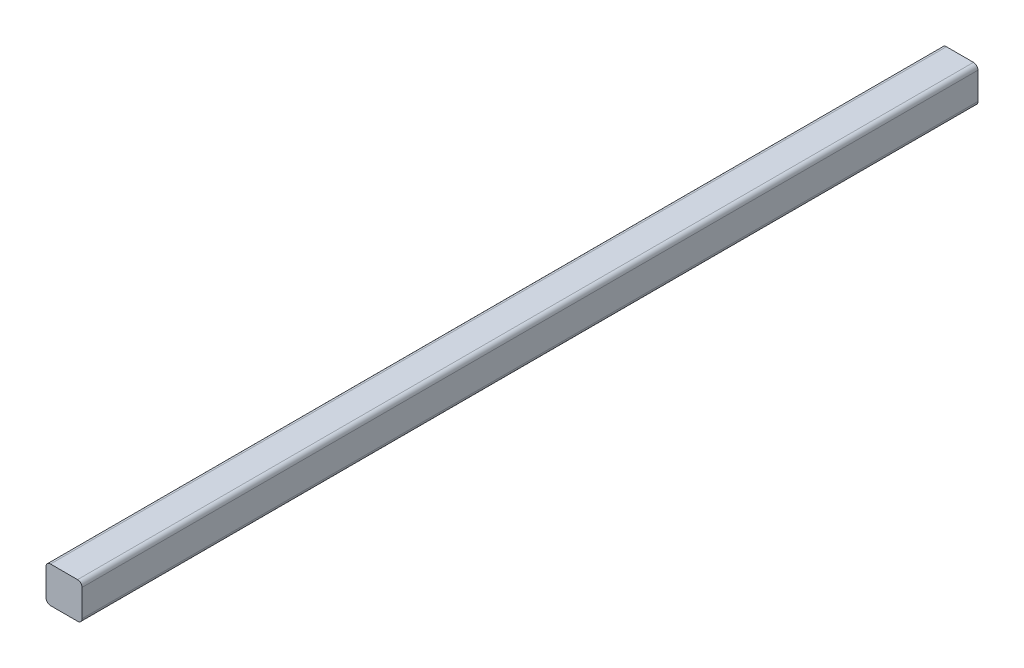
ISO-10303-21;
HEADER;
FILE_DESCRIPTION(('STEP AP214'),'2;1');
FILE_NAME('part.step','',(''),(''),'','','');
FILE_SCHEMA(('AUTOMOTIVE_DESIGN { 1 0 10303 214 1 1 1 1 }'));
ENDSEC;
DATA;
#1=APPLICATION_CONTEXT('core data for automotive mechanical design processes');
#2=APPLICATION_PROTOCOL_DEFINITION('international standard','automotive_design',2000,#1);
#3=PRODUCT_CONTEXT('',#1,'mechanical');
#4=PRODUCT('Part','Part','',(#3));
#5=PRODUCT_RELATED_PRODUCT_CATEGORY('part','',(#4));
#6=PRODUCT_DEFINITION_FORMATION('','',#4);
#7=PRODUCT_DEFINITION_CONTEXT('part definition',#1,'design');
#8=PRODUCT_DEFINITION('design','',#6,#7);
#9=PRODUCT_DEFINITION_SHAPE('','',#8);
#10=(LENGTH_UNIT() NAMED_UNIT(*) SI_UNIT(.MILLI.,.METRE.));
#11=(NAMED_UNIT(*) PLANE_ANGLE_UNIT() SI_UNIT($,.RADIAN.));
#12=(NAMED_UNIT(*) SI_UNIT($,.STERADIAN.) SOLID_ANGLE_UNIT());
#13=UNCERTAINTY_MEASURE_WITH_UNIT(LENGTH_MEASURE(1.E-05),#10,'distance_accuracy_value','');
#14=(GEOMETRIC_REPRESENTATION_CONTEXT(3) GLOBAL_UNCERTAINTY_ASSIGNED_CONTEXT((#13)) GLOBAL_UNIT_ASSIGNED_CONTEXT((#10,
#11,#12)) REPRESENTATION_CONTEXT('',''));
#15=CARTESIAN_POINT('',(0.,0.,0.));
#16=DIRECTION('',(0.,0.,1.));
#17=DIRECTION('',(1.,0.,0.));
#18=AXIS2_PLACEMENT_3D('',#15,#16,#17);
#19=CARTESIAN_POINT('',(-819.830594651,0.,-946.658829023292));
#20=DIRECTION('',(0.,0.,-1.));
#21=DIRECTION('',(-1.,0.,0.));
#22=AXIS2_PLACEMENT_3D('',#19,#20,#21);
#23=PLANE('',#22);
#24=DIRECTION('',(0.,-1.,0.));
#25=VECTOR('',#24,1.);
#26=CARTESIAN_POINT('',(-585.932187925,0.,-946.658829023292));
#27=LINE('',#26,#25);
#28=CARTESIAN_POINT('',(-585.932187925,510.53216465162,-946.658829023292));
#29=VERTEX_POINT('',#28);
#30=CARTESIAN_POINT('',(-585.932187925,481.95716465162,-946.658829023292));
#31=VERTEX_POINT('',#30);
#32=EDGE_CURVE('E128',#29,#31,#27,.T.);
#33=ORIENTED_EDGE('',*,*,#32,.F.);
#34=CARTESIAN_POINT('',(-581.169687925,510.53216465162,-946.658829023292));
#35=DIRECTION('',(0.,0.,-1.));
#36=DIRECTION('',(-1.,0.,0.));
#37=AXIS2_PLACEMENT_3D('',#34,#35,#36);
#38=CIRCLE('',#37,4.7625);
#39=CARTESIAN_POINT('',(-581.169687925,515.29466465162,-946.658829023292));
#40=VERTEX_POINT('',#39);
#41=EDGE_CURVE('E134',#29,#40,#38,.T.);
#42=ORIENTED_EDGE('',*,*,#41,.T.);
#43=DIRECTION('',(-1.,0.,0.));
#44=VECTOR('',#43,1.);
#45=CARTESIAN_POINT('',(0.,515.29466465162,-946.658829023292));
#46=LINE('',#45,#44);
#47=CARTESIAN_POINT('',(-552.594687925,515.29466465162,-946.658829023292));
#48=VERTEX_POINT('',#47);
#49=EDGE_CURVE('E120',#48,#40,#46,.T.);
#50=ORIENTED_EDGE('',*,*,#49,.F.);
#51=CARTESIAN_POINT('',(-552.594687925,510.53216465162,-946.658829023292));
#52=DIRECTION('',(0.,0.,-1.));
#53=DIRECTION('',(-1.,0.,0.));
#54=AXIS2_PLACEMENT_3D('',#51,#52,#53);
#55=CIRCLE('',#54,4.7625);
#56=CARTESIAN_POINT('',(-547.832187925,510.53216465162,-946.658829023292));
#57=VERTEX_POINT('',#56);
#58=EDGE_CURVE('E131',#48,#57,#55,.T.);
#59=ORIENTED_EDGE('',*,*,#58,.T.);
#60=DIRECTION('',(0.,1.,0.));
#61=VECTOR('',#60,1.);
#62=CARTESIAN_POINT('',(-547.832187924999,-1.22622804603596E-12,-946.658829023292));
#63=LINE('',#62,#61);
#64=CARTESIAN_POINT('',(-547.832187925,481.95716465162,-946.658829023292));
#65=VERTEX_POINT('',#64);
#66=EDGE_CURVE('E136',#65,#57,#63,.T.);
#67=ORIENTED_EDGE('',*,*,#66,.F.);
#68=CARTESIAN_POINT('',(-552.594687925,481.95716465162,-946.658829023292));
#69=DIRECTION('',(0.,0.,-1.));
#70=DIRECTION('',(-1.,0.,0.));
#71=AXIS2_PLACEMENT_3D('',#68,#69,#70);
#72=CIRCLE('',#71,4.7625);
#73=CARTESIAN_POINT('',(-552.594687925,477.19466465162,-946.658829023292));
#74=VERTEX_POINT('',#73);
#75=EDGE_CURVE('E64',#65,#74,#72,.T.);
#76=ORIENTED_EDGE('',*,*,#75,.T.);
#77=DIRECTION('',(1.,0.,0.));
#78=VECTOR('',#77,1.);
#79=CARTESIAN_POINT('',(-6.95265753181772E-13,477.19466465162,-946.658829023292));
#80=LINE('',#79,#78);
#81=CARTESIAN_POINT('',(-581.169687925,477.19466465162,-946.658829023292));
#82=VERTEX_POINT('',#81);
#83=EDGE_CURVE('E180',#82,#74,#80,.T.);
#84=ORIENTED_EDGE('',*,*,#83,.F.);
#85=CARTESIAN_POINT('',(-581.169687925,481.95716465162,-946.658829023292));
#86=DIRECTION('',(0.,0.,-1.));
#87=DIRECTION('',(-1.,0.,0.));
#88=AXIS2_PLACEMENT_3D('',#85,#86,#87);
#89=CIRCLE('',#88,4.7625);
#90=EDGE_CURVE('E146',#82,#31,#89,.T.);
#91=ORIENTED_EDGE('',*,*,#90,.T.);
#92=EDGE_LOOP('',(#33,#42,#50,#59,#67,#76,#84,#91));
#93=FACE_BOUND('',#92,.T.);
#94=ADVANCED_FACE('F48',(#93),#23,.T.);
#95=CARTESIAN_POINT('',(0.,0.,0.));
#96=DIRECTION('',(0.,0.,1.));
#97=DIRECTION('',(1.,0.,0.));
#98=AXIS2_PLACEMENT_3D('',#95,#96,#97);
#99=PLANE('',#98);
#100=DIRECTION('',(-1.,0.,0.));
#101=VECTOR('',#100,1.);
#102=CARTESIAN_POINT('',(-585.932187925,515.29466465162,0.));
#103=LINE('',#102,#101);
#104=CARTESIAN_POINT('',(-552.594687925,515.29466465162,0.));
#105=VERTEX_POINT('',#104);
#106=CARTESIAN_POINT('',(-581.169687925,515.29466465162,0.));
#107=VERTEX_POINT('',#106);
#108=EDGE_CURVE('E123',#105,#107,#103,.T.);
#109=ORIENTED_EDGE('',*,*,#108,.T.);
#110=CARTESIAN_POINT('',(-581.169687925,510.53216465162,0.));
#111=DIRECTION('',(0.,0.,1.));
#112=DIRECTION('',(1.,0.,0.));
#113=AXIS2_PLACEMENT_3D('',#110,#111,#112);
#114=CIRCLE('',#113,4.7625);
#115=CARTESIAN_POINT('',(-585.932187925,510.53216465162,0.));
#116=VERTEX_POINT('',#115);
#117=EDGE_CURVE('E204',#107,#116,#114,.T.);
#118=ORIENTED_EDGE('',*,*,#117,.T.);
#119=DIRECTION('',(0.,-1.,0.));
#120=VECTOR('',#119,1.);
#121=CARTESIAN_POINT('',(-585.932187925,515.29466465162,0.));
#122=LINE('',#121,#120);
#123=CARTESIAN_POINT('',(-585.932187925,481.95716465162,0.));
#124=VERTEX_POINT('',#123);
#125=EDGE_CURVE('E182',#116,#124,#122,.T.);
#126=ORIENTED_EDGE('',*,*,#125,.T.);
#127=CARTESIAN_POINT('',(-581.169687925,481.95716465162,0.));
#128=DIRECTION('',(0.,0.,1.));
#129=DIRECTION('',(1.,0.,0.));
#130=AXIS2_PLACEMENT_3D('',#127,#128,#129);
#131=CIRCLE('',#130,4.7625);
#132=CARTESIAN_POINT('',(-581.169687925,477.19466465162,0.));
#133=VERTEX_POINT('',#132);
#134=EDGE_CURVE('E201',#124,#133,#131,.T.);
#135=ORIENTED_EDGE('',*,*,#134,.T.);
#136=DIRECTION('',(1.,0.,0.));
#137=VECTOR('',#136,1.);
#138=CARTESIAN_POINT('',(-585.932187925,477.19466465162,0.));
#139=LINE('',#138,#137);
#140=CARTESIAN_POINT('',(-552.594687925,477.19466465162,0.));
#141=VERTEX_POINT('',#140);
#142=EDGE_CURVE('E175',#133,#141,#139,.T.);
#143=ORIENTED_EDGE('',*,*,#142,.T.);
#144=CARTESIAN_POINT('',(-552.594687925,481.95716465162,0.));
#145=DIRECTION('',(0.,0.,1.));
#146=DIRECTION('',(1.,0.,0.));
#147=AXIS2_PLACEMENT_3D('',#144,#145,#146);
#148=CIRCLE('',#147,4.7625);
#149=CARTESIAN_POINT('',(-547.832187925,481.95716465162,0.));
#150=VERTEX_POINT('',#149);
#151=EDGE_CURVE('E173',#141,#150,#148,.T.);
#152=ORIENTED_EDGE('',*,*,#151,.T.);
#153=DIRECTION('',(0.,1.,0.));
#154=VECTOR('',#153,1.);
#155=CARTESIAN_POINT('',(-547.832187925,515.29466465162,0.));
#156=LINE('',#155,#154);
#157=CARTESIAN_POINT('',(-547.832187925,510.53216465162,0.));
#158=VERTEX_POINT('',#157);
#159=EDGE_CURVE('E167',#150,#158,#156,.T.);
#160=ORIENTED_EDGE('',*,*,#159,.T.);
#161=CARTESIAN_POINT('',(-552.594687925,510.53216465162,0.));
#162=DIRECTION('',(0.,0.,1.));
#163=DIRECTION('',(1.,0.,0.));
#164=AXIS2_PLACEMENT_3D('',#161,#162,#163);
#165=CIRCLE('',#164,4.7625);
#166=EDGE_CURVE('E171',#158,#105,#165,.T.);
#167=ORIENTED_EDGE('',*,*,#166,.T.);
#168=EDGE_LOOP('',(#109,#118,#126,#135,#143,#152,#160,#167));
#169=FACE_BOUND('',#168,.T.);
#170=ADVANCED_FACE('F170',(#169),#99,.T.);
#171=CARTESIAN_POINT('',(-585.932187925,477.19466465162,-1000.54036574971));
#172=DIRECTION('',(0.,-1.,0.));
#173=DIRECTION('',(0.,0.,-1.));
#174=AXIS2_PLACEMENT_3D('',#171,#172,#173);
#175=PLANE('',#174);
#176=ORIENTED_EDGE('',*,*,#142,.F.);
#177=DIRECTION('',(0.,0.,1.));
#178=VECTOR('',#177,1.);
#179=CARTESIAN_POINT('',(-581.169687925,477.19466465162,-1000.54036574971));
#180=LINE('',#179,#178);
#181=EDGE_CURVE('E71',#133,#82,#180,.F.);
#182=ORIENTED_EDGE('',*,*,#181,.T.);
#183=ORIENTED_EDGE('',*,*,#83,.T.);
#184=DIRECTION('',(0.,0.,1.));
#185=VECTOR('',#184,1.);
#186=CARTESIAN_POINT('',(-552.594687925,477.19466465162,-1000.54036574971));
#187=LINE('',#186,#185);
#188=EDGE_CURVE('E156',#74,#141,#187,.T.);
#189=ORIENTED_EDGE('',*,*,#188,.T.);
#190=EDGE_LOOP('',(#176,#182,#183,#189));
#191=FACE_BOUND('',#190,.T.);
#192=ADVANCED_FACE('F233',(#191),#175,.T.);
#193=CARTESIAN_POINT('',(-547.832187925,515.29466465162,-1000.54036574971));
#194=DIRECTION('',(1.,0.,0.));
#195=DIRECTION('',(0.,0.,-1.));
#196=AXIS2_PLACEMENT_3D('',#193,#194,#195);
#197=PLANE('',#196);
#198=ORIENTED_EDGE('',*,*,#159,.F.);
#199=DIRECTION('',(0.,0.,1.));
#200=VECTOR('',#199,1.);
#201=CARTESIAN_POINT('',(-547.832187925,481.95716465162,-1000.54036574971));
#202=LINE('',#201,#200);
#203=EDGE_CURVE('E13',#150,#65,#202,.F.);
#204=ORIENTED_EDGE('',*,*,#203,.T.);
#205=ORIENTED_EDGE('',*,*,#66,.T.);
#206=DIRECTION('',(0.,0.,1.));
#207=VECTOR('',#206,1.);
#208=CARTESIAN_POINT('',(-547.832187925,510.53216465162,-1000.54036574971));
#209=LINE('',#208,#207);
#210=EDGE_CURVE('E57',#57,#158,#209,.T.);
#211=ORIENTED_EDGE('',*,*,#210,.T.);
#212=EDGE_LOOP('',(#198,#204,#205,#211));
#213=FACE_BOUND('',#212,.T.);
#214=ADVANCED_FACE('F166',(#213),#197,.T.);
#215=CARTESIAN_POINT('',(-585.932187925,515.29466465162,-1000.54036574971));
#216=DIRECTION('',(0.,1.,0.));
#217=DIRECTION('',(0.,0.,1.));
#218=AXIS2_PLACEMENT_3D('',#215,#216,#217);
#219=PLANE('',#218);
#220=ORIENTED_EDGE('',*,*,#49,.T.);
#221=DIRECTION('',(0.,0.,1.));
#222=VECTOR('',#221,1.);
#223=CARTESIAN_POINT('',(-581.169687925,515.29466465162,-1000.54036574971));
#224=LINE('',#223,#222);
#225=EDGE_CURVE('E127',#40,#107,#224,.T.);
#226=ORIENTED_EDGE('',*,*,#225,.T.);
#227=ORIENTED_EDGE('',*,*,#108,.F.);
#228=DIRECTION('',(0.,0.,1.));
#229=VECTOR('',#228,1.);
#230=CARTESIAN_POINT('',(-552.594687925,515.29466465162,-1000.54036574971));
#231=LINE('',#230,#229);
#232=EDGE_CURVE('E116',#105,#48,#231,.F.);
#233=ORIENTED_EDGE('',*,*,#232,.T.);
#234=EDGE_LOOP('',(#220,#226,#227,#233));
#235=FACE_BOUND('',#234,.T.);
#236=ADVANCED_FACE('F118',(#235),#219,.T.);
#237=CARTESIAN_POINT('',(-585.932187925,515.29466465162,-1000.54036574971));
#238=DIRECTION('',(-1.,0.,0.));
#239=DIRECTION('',(0.,0.,1.));
#240=AXIS2_PLACEMENT_3D('',#237,#238,#239);
#241=PLANE('',#240);
#242=ORIENTED_EDGE('',*,*,#125,.F.);
#243=DIRECTION('',(0.,0.,1.));
#244=VECTOR('',#243,1.);
#245=CARTESIAN_POINT('',(-585.932187925,510.53216465162,-1000.54036574971));
#246=LINE('',#245,#244);
#247=EDGE_CURVE('E141',#116,#29,#246,.F.);
#248=ORIENTED_EDGE('',*,*,#247,.T.);
#249=ORIENTED_EDGE('',*,*,#32,.T.);
#250=DIRECTION('',(0.,0.,1.));
#251=VECTOR('',#250,1.);
#252=CARTESIAN_POINT('',(-585.932187925,481.95716465162,-1000.54036574971));
#253=LINE('',#252,#251);
#254=EDGE_CURVE('E148',#31,#124,#253,.T.);
#255=ORIENTED_EDGE('',*,*,#254,.T.);
#256=EDGE_LOOP('',(#242,#248,#249,#255));
#257=FACE_BOUND('',#256,.T.);
#258=ADVANCED_FACE('F212',(#257),#241,.T.);
#259=CARTESIAN_POINT('',(-581.169687925,510.53216465162,-1000.54036574971));
#260=DIRECTION('',(0.,0.,1.));
#261=DIRECTION('',(1.,0.,0.));
#262=AXIS2_PLACEMENT_3D('',#259,#260,#261);
#263=CYLINDRICAL_SURFACE('',#262,4.7625);
#264=ORIENTED_EDGE('',*,*,#41,.F.);
#265=ORIENTED_EDGE('',*,*,#247,.F.);
#266=ORIENTED_EDGE('',*,*,#117,.F.);
#267=ORIENTED_EDGE('',*,*,#225,.F.);
#268=EDGE_LOOP('',(#264,#265,#266,#267));
#269=FACE_BOUND('',#268,.T.);
#270=ADVANCED_FACE('F217',(#269),#263,.T.);
#271=CARTESIAN_POINT('',(-581.169687925,481.95716465162,-1000.54036574971));
#272=DIRECTION('',(0.,0.,1.));
#273=DIRECTION('',(1.,0.,0.));
#274=AXIS2_PLACEMENT_3D('',#271,#272,#273);
#275=CYLINDRICAL_SURFACE('',#274,4.7625);
#276=ORIENTED_EDGE('',*,*,#90,.F.);
#277=ORIENTED_EDGE('',*,*,#181,.F.);
#278=ORIENTED_EDGE('',*,*,#134,.F.);
#279=ORIENTED_EDGE('',*,*,#254,.F.);
#280=EDGE_LOOP('',(#276,#277,#278,#279));
#281=FACE_BOUND('',#280,.T.);
#282=ADVANCED_FACE('F218',(#281),#275,.T.);
#283=CARTESIAN_POINT('',(-552.594687925,481.95716465162,-1000.54036574971));
#284=DIRECTION('',(0.,0.,1.));
#285=DIRECTION('',(1.,0.,0.));
#286=AXIS2_PLACEMENT_3D('',#283,#284,#285);
#287=CYLINDRICAL_SURFACE('',#286,4.7625);
#288=ORIENTED_EDGE('',*,*,#75,.F.);
#289=ORIENTED_EDGE('',*,*,#203,.F.);
#290=ORIENTED_EDGE('',*,*,#151,.F.);
#291=ORIENTED_EDGE('',*,*,#188,.F.);
#292=EDGE_LOOP('',(#288,#289,#290,#291));
#293=FACE_BOUND('',#292,.T.);
#294=ADVANCED_FACE('F220',(#293),#287,.T.);
#295=CARTESIAN_POINT('',(-552.594687925,510.53216465162,-1000.54036574971));
#296=DIRECTION('',(0.,0.,1.));
#297=DIRECTION('',(1.,0.,0.));
#298=AXIS2_PLACEMENT_3D('',#295,#296,#297);
#299=CYLINDRICAL_SURFACE('',#298,4.7625);
#300=ORIENTED_EDGE('',*,*,#58,.F.);
#301=ORIENTED_EDGE('',*,*,#232,.F.);
#302=ORIENTED_EDGE('',*,*,#166,.F.);
#303=ORIENTED_EDGE('',*,*,#210,.F.);
#304=EDGE_LOOP('',(#300,#301,#302,#303));
#305=FACE_BOUND('',#304,.T.);
#306=ADVANCED_FACE('F50',(#305),#299,.T.);
#307=CLOSED_SHELL('',(#94,#170,#192,#214,#236,#258,#270,#282,#294,#306));
#308=MANIFOLD_SOLID_BREP('B2',#307);
#309=ADVANCED_BREP_SHAPE_REPRESENTATION('',(#18,#308),#14);
#310=SHAPE_DEFINITION_REPRESENTATION(#9,#309);
ENDSEC;
END-ISO-10303-21;
